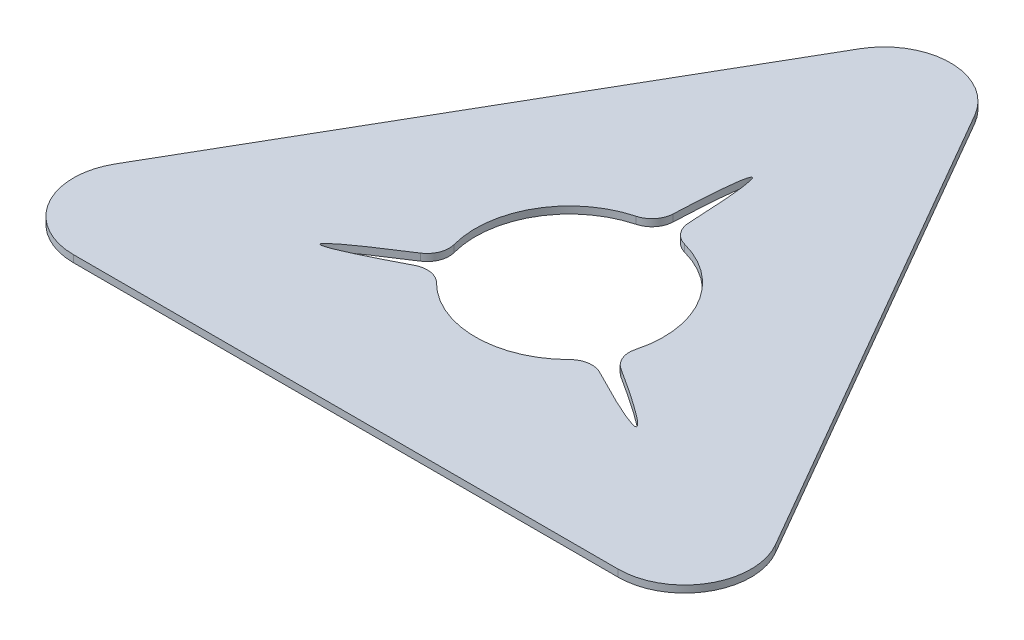
ISO-10303-21;
HEADER;
FILE_DESCRIPTION(('STEP AP214'),'2;1');
FILE_NAME('part.step','',(''),(''),'','','');
FILE_SCHEMA(('AUTOMOTIVE_DESIGN { 1 0 10303 214 1 1 1 1 }'));
ENDSEC;
DATA;
#1=APPLICATION_CONTEXT('core data for automotive mechanical design processes');
#2=APPLICATION_PROTOCOL_DEFINITION('international standard','automotive_design',2000,#1);
#3=PRODUCT_CONTEXT('',#1,'mechanical');
#4=PRODUCT('Part','Part','',(#3));
#5=PRODUCT_RELATED_PRODUCT_CATEGORY('part','',(#4));
#6=PRODUCT_DEFINITION_FORMATION('','',#4);
#7=PRODUCT_DEFINITION_CONTEXT('part definition',#1,'design');
#8=PRODUCT_DEFINITION('design','',#6,#7);
#9=PRODUCT_DEFINITION_SHAPE('','',#8);
#10=(LENGTH_UNIT() NAMED_UNIT(*) SI_UNIT(.MILLI.,.METRE.));
#11=(NAMED_UNIT(*) PLANE_ANGLE_UNIT() SI_UNIT($,.RADIAN.));
#12=(NAMED_UNIT(*) SI_UNIT($,.STERADIAN.) SOLID_ANGLE_UNIT());
#13=UNCERTAINTY_MEASURE_WITH_UNIT(LENGTH_MEASURE(1.E-05),#10,'distance_accuracy_value','');
#14=(GEOMETRIC_REPRESENTATION_CONTEXT(3) GLOBAL_UNCERTAINTY_ASSIGNED_CONTEXT((#13)) GLOBAL_UNIT_ASSIGNED_CONTEXT((#10,
#11,#12)) REPRESENTATION_CONTEXT('',''));
#15=CARTESIAN_POINT('',(0.,0.,0.));
#16=DIRECTION('',(0.,0.,1.));
#17=DIRECTION('',(1.,0.,0.));
#18=AXIS2_PLACEMENT_3D('',#15,#16,#17);
#19=CARTESIAN_POINT('',(0.,0.,404.145188432738));
#20=DIRECTION('',(0.,1.,0.));
#21=DIRECTION('',(0.,0.,1.));
#22=AXIS2_PLACEMENT_3D('',#19,#20,#21);
#23=CYLINDRICAL_SURFACE('',#22,85.);
#24=CARTESIAN_POINT('',(0.,6.35,404.145188432738));
#25=DIRECTION('',(0.,1.,0.));
#26=DIRECTION('',(0.,0.,1.));
#27=AXIS2_PLACEMENT_3D('',#24,#25,#26);
#28=CIRCLE('',#27,85.);
#29=CARTESIAN_POINT('',(-60.1874642350695,6.35,464.165761147035));
#30=VERTEX_POINT('',#29);
#31=CARTESIAN_POINT('',(60.1874642350686,6.35,464.165761147036));
#32=VERTEX_POINT('',#31);
#33=EDGE_CURVE('E290',#30,#32,#28,.T.);
#34=ORIENTED_EDGE('',*,*,#33,.T.);
#35=DIRECTION('',(0.,1.,0.));
#36=VECTOR('',#35,1.);
#37=CARTESIAN_POINT('',(60.1874642350686,0.,464.165761147036));
#38=LINE('',#37,#36);
#39=CARTESIAN_POINT('',(60.1874642350686,0.,464.165761147036));
#40=VERTEX_POINT('',#39);
#41=EDGE_CURVE('E248',#32,#40,#38,.F.);
#42=ORIENTED_EDGE('',*,*,#41,.T.);
#43=CARTESIAN_POINT('',(0.,0.,404.145188432738));
#44=DIRECTION('',(0.,1.,0.));
#45=DIRECTION('',(0.,0.,1.));
#46=AXIS2_PLACEMENT_3D('',#43,#44,#45);
#47=CIRCLE('',#46,85.);
#48=CARTESIAN_POINT('',(-60.1874642350695,0.,464.165761147035));
#49=VERTEX_POINT('',#48);
#50=EDGE_CURVE('E292',#49,#40,#47,.T.);
#51=ORIENTED_EDGE('',*,*,#50,.F.);
#52=DIRECTION('',(0.,1.,0.));
#53=VECTOR('',#52,1.);
#54=CARTESIAN_POINT('',(-60.1874642350695,0.,464.165761147035));
#55=LINE('',#54,#53);
#56=EDGE_CURVE('E245',#49,#30,#55,.T.);
#57=ORIENTED_EDGE('',*,*,#56,.T.);
#58=EDGE_LOOP('',(#34,#42,#51,#57));
#59=FACE_BOUND('',#58,.T.);
#60=ADVANCED_FACE('F33',(#59),#23,.F.);
#61=CARTESIAN_POINT('',(-21.8856086027386,6.35,322.011029058652));
#62=VERTEX_POINT('',#61);
#63=CARTESIAN_POINT('',(-82.0730728378077,6.35,426.258775092525));
#64=VERTEX_POINT('',#63);
#65=EDGE_CURVE('E281',#62,#64,#28,.T.);
#66=ORIENTED_EDGE('',*,*,#65,.T.);
#67=DIRECTION('',(0.,1.,0.));
#68=VECTOR('',#67,1.);
#69=CARTESIAN_POINT('',(-82.0730728378077,0.,426.258775092525));
#70=LINE('',#69,#68);
#71=CARTESIAN_POINT('',(-82.0730728378077,0.,426.258775092525));
#72=VERTEX_POINT('',#71);
#73=EDGE_CURVE('E257',#64,#72,#70,.F.);
#74=ORIENTED_EDGE('',*,*,#73,.T.);
#75=CARTESIAN_POINT('',(-21.8856086027386,0.,322.011029058652));
#76=VERTEX_POINT('',#75);
#77=EDGE_CURVE('E190',#76,#72,#47,.T.);
#78=ORIENTED_EDGE('',*,*,#77,.F.);
#79=DIRECTION('',(0.,1.,0.));
#80=VECTOR('',#79,1.);
#81=CARTESIAN_POINT('',(-21.8856086027386,0.,322.011029058652));
#82=LINE('',#81,#80);
#83=EDGE_CURVE('E254',#76,#62,#82,.T.);
#84=ORIENTED_EDGE('',*,*,#83,.T.);
#85=EDGE_LOOP('',(#66,#74,#78,#84));
#86=FACE_BOUND('',#85,.T.);
#87=ADVANCED_FACE('F280',(#86),#23,.F.);
#88=CARTESIAN_POINT('',(350.,6.35,606.217782649107));
#89=DIRECTION('',(-0.866025403784439,0.,0.5));
#90=DIRECTION('',(0.5,0.,0.866025403784439));
#91=AXIS2_PLACEMENT_3D('',#88,#89,#90);
#92=PLANE('',#91);
#93=DIRECTION('',(-0.5,0.,-0.866025403784439));
#94=VECTOR('',#93,1.);
#95=CARTESIAN_POINT('',(350.,0.,606.217782649107));
#96=LINE('',#95,#94);
#97=CARTESIAN_POINT('',(298.038475772933,0.,516.217782649107));
#98=VERTEX_POINT('',#97);
#99=CARTESIAN_POINT('',(51.9615242270664,0.,90.0000000000002));
#100=VERTEX_POINT('',#99);
#101=EDGE_CURVE('E185',#98,#100,#96,.T.);
#102=ORIENTED_EDGE('',*,*,#101,.T.);
#103=DIRECTION('',(0.,-1.,0.));
#104=VECTOR('',#103,1.);
#105=CARTESIAN_POINT('',(51.9615242270663,6.35,90.));
#106=LINE('',#105,#104);
#107=CARTESIAN_POINT('',(51.9615242270664,6.35,90.0000000000002));
#108=VERTEX_POINT('',#107);
#109=EDGE_CURVE('E163',#100,#108,#106,.F.);
#110=ORIENTED_EDGE('',*,*,#109,.T.);
#111=DIRECTION('',(-0.5,0.,-0.866025403784439));
#112=VECTOR('',#111,1.);
#113=CARTESIAN_POINT('',(350.,6.35,606.217782649107));
#114=LINE('',#113,#112);
#115=CARTESIAN_POINT('',(298.038475772933,6.35,516.217782649107));
#116=VERTEX_POINT('',#115);
#117=EDGE_CURVE('E188',#116,#108,#114,.T.);
#118=ORIENTED_EDGE('',*,*,#117,.F.);
#119=DIRECTION('',(0.,-1.,0.));
#120=VECTOR('',#119,1.);
#121=CARTESIAN_POINT('',(298.038475772933,6.35,516.217782649107));
#122=LINE('',#121,#120);
#123=EDGE_CURVE('E168',#116,#98,#122,.T.);
#124=ORIENTED_EDGE('',*,*,#123,.T.);
#125=EDGE_LOOP('',(#102,#110,#118,#124));
#126=FACE_BOUND('',#125,.T.);
#127=ADVANCED_FACE('F367',(#126),#92,.F.);
#128=CARTESIAN_POINT('',(0.,6.35,0.));
#129=DIRECTION('',(0.866025403784439,0.,0.5));
#130=DIRECTION('',(0.5,0.,-0.866025403784439));
#131=AXIS2_PLACEMENT_3D('',#128,#129,#130);
#132=PLANE('',#131);
#133=DIRECTION('',(-0.5,0.,0.866025403784439));
#134=VECTOR('',#133,1.);
#135=CARTESIAN_POINT('',(0.,6.35,0.));
#136=LINE('',#135,#134);
#137=CARTESIAN_POINT('',(-51.9615242270663,6.35,90.));
#138=VERTEX_POINT('',#137);
#139=CARTESIAN_POINT('',(-298.038475772934,6.35,516.217782649107));
#140=VERTEX_POINT('',#139);
#141=EDGE_CURVE('E178',#138,#140,#136,.T.);
#142=ORIENTED_EDGE('',*,*,#141,.F.);
#143=DIRECTION('',(0.,-1.,0.));
#144=VECTOR('',#143,1.);
#145=CARTESIAN_POINT('',(-51.9615242270663,6.35,90.));
#146=LINE('',#145,#144);
#147=CARTESIAN_POINT('',(-51.9615242270663,0.,90.));
#148=VERTEX_POINT('',#147);
#149=EDGE_CURVE('E162',#138,#148,#146,.T.);
#150=ORIENTED_EDGE('',*,*,#149,.T.);
#151=DIRECTION('',(-0.5,0.,0.866025403784439));
#152=VECTOR('',#151,1.);
#153=CARTESIAN_POINT('',(0.,0.,0.));
#154=LINE('',#153,#152);
#155=CARTESIAN_POINT('',(-298.038475772934,0.,516.217782649107));
#156=VERTEX_POINT('',#155);
#157=EDGE_CURVE('E175',#148,#156,#154,.T.);
#158=ORIENTED_EDGE('',*,*,#157,.T.);
#159=DIRECTION('',(0.,-1.,0.));
#160=VECTOR('',#159,1.);
#161=CARTESIAN_POINT('',(-298.038475772934,6.35,516.217782649107));
#162=LINE('',#161,#160);
#163=EDGE_CURVE('E180',#156,#140,#162,.F.);
#164=ORIENTED_EDGE('',*,*,#163,.T.);
#165=EDGE_LOOP('',(#142,#150,#158,#164));
#166=FACE_BOUND('',#165,.T.);
#167=ADVANCED_FACE('F174',(#166),#132,.F.);
#168=CARTESIAN_POINT('',(-350.,6.35,606.217782649107));
#169=DIRECTION('',(0.,0.,-1.));
#170=DIRECTION('',(-1.,0.,0.));
#171=AXIS2_PLACEMENT_3D('',#168,#169,#170);
#172=PLANE('',#171);
#173=DIRECTION('',(1.,0.,0.));
#174=VECTOR('',#173,1.);
#175=CARTESIAN_POINT('',(-350.,0.,606.217782649107));
#176=LINE('',#175,#174);
#177=CARTESIAN_POINT('',(-246.076951545867,0.,606.217782649107));
#178=VERTEX_POINT('',#177);
#179=CARTESIAN_POINT('',(246.076951545867,0.,606.217782649107));
#180=VERTEX_POINT('',#179);
#181=EDGE_CURVE('E184',#178,#180,#176,.T.);
#182=ORIENTED_EDGE('',*,*,#181,.T.);
#183=DIRECTION('',(0.,-1.,0.));
#184=VECTOR('',#183,1.);
#185=CARTESIAN_POINT('',(246.076951545867,6.35,606.217782649107));
#186=LINE('',#185,#184);
#187=CARTESIAN_POINT('',(246.076951545867,6.35,606.217782649107));
#188=VERTEX_POINT('',#187);
#189=EDGE_CURVE('E210',#180,#188,#186,.F.);
#190=ORIENTED_EDGE('',*,*,#189,.T.);
#191=DIRECTION('',(1.,0.,0.));
#192=VECTOR('',#191,1.);
#193=CARTESIAN_POINT('',(-350.,6.35,606.217782649107));
#194=LINE('',#193,#192);
#195=CARTESIAN_POINT('',(-246.076951545867,6.35,606.217782649107));
#196=VERTEX_POINT('',#195);
#197=EDGE_CURVE('E194',#196,#188,#194,.T.);
#198=ORIENTED_EDGE('',*,*,#197,.F.);
#199=DIRECTION('',(0.,-1.,0.));
#200=VECTOR('',#199,1.);
#201=CARTESIAN_POINT('',(-246.076951545867,6.35,606.217782649107));
#202=LINE('',#201,#200);
#203=EDGE_CURVE('E207',#196,#178,#202,.T.);
#204=ORIENTED_EDGE('',*,*,#203,.T.);
#205=EDGE_LOOP('',(#182,#190,#198,#204));
#206=FACE_BOUND('',#205,.T.);
#207=ADVANCED_FACE('F359',(#206),#172,.F.);
#208=CARTESIAN_POINT('',(0.,6.35,0.));
#209=DIRECTION('',(0.,1.,0.));
#210=DIRECTION('',(0.,0.,1.));
#211=AXIS2_PLACEMENT_3D('',#208,#209,#210);
#212=PLANE('',#211);
#213=CARTESIAN_POINT('',(82.0730728378073,6.35,426.258775092526));
#214=VERTEX_POINT('',#213);
#215=CARTESIAN_POINT('',(21.8856086027386,6.35,322.011029058652));
#216=VERTEX_POINT('',#215);
#217=EDGE_CURVE('E274',#214,#216,#28,.T.);
#218=ORIENTED_EDGE('',*,*,#217,.F.);
#219=CARTESIAN_POINT('',(101.384384093762,6.35,431.461971953653));
#220=DIRECTION('',(0.,1.,0.));
#221=DIRECTION('',(0.,0.,1.));
#222=AXIS2_PLACEMENT_3D('',#219,#220,#221);
#223=CIRCLE('',#222,20.);
#224=CARTESIAN_POINT('',(90.6394431593238,6.35,448.330470532822));
#225=VERTEX_POINT('',#224);
#226=EDGE_CURVE('E228',#214,#225,#223,.T.);
#227=ORIENTED_EDGE('',*,*,#226,.T.);
#228=CARTESIAN_POINT('',(21.4807621135331,6.35,426.939417066798));
#229=CARTESIAN_POINT('',(545.596004384195,6.35,719.14518843274));
#230=CARTESIAN_POINT('',(30.4807621135332,6.35,411.350959798678));
#231=(BOUNDED_CURVE() B_SPLINE_CURVE(2,(#228,#229,#230),.UNSPECIFIED.,.F.,
.F.) B_SPLINE_CURVE_WITH_KNOTS((3,3),(0.,1.),
.UNSPECIFIED.) CURVE() GEOMETRIC_REPRESENTATION_ITEM() RATIONAL_B_SPLINE_CURVE((1.,
0.290322580645161,1.)) REPRESENTATION_ITEM(''));
#232=CARTESIAN_POINT('',(83.585298351716,6.35,460.548607743546));
#233=VERTEX_POINT('',#232);
#234=EDGE_CURVE('E307',#233,#225,#231,.T.);
#235=ORIENTED_EDGE('',*,*,#234,.F.);
#236=CARTESIAN_POINT('',(74.3492205256728,6.35,478.288248844518));
#237=DIRECTION('',(0.,1.,0.));
#238=DIRECTION('',(0.,0.,1.));
#239=AXIS2_PLACEMENT_3D('',#236,#237,#238);
#240=CIRCLE('',#239,20.);
#241=EDGE_CURVE('E226',#233,#32,#240,.T.);
#242=ORIENTED_EDGE('',*,*,#241,.T.);
#243=ORIENTED_EDGE('',*,*,#33,.F.);
#244=CARTESIAN_POINT('',(-74.3492205256741,6.35,478.288248844517));
#245=DIRECTION('',(0.,1.,0.));
#246=DIRECTION('',(0.,0.,1.));
#247=AXIS2_PLACEMENT_3D('',#244,#245,#246);
#248=CIRCLE('',#247,20.);
#249=CARTESIAN_POINT('',(-83.5852983517173,6.35,460.548607743545));
#250=VERTEX_POINT('',#249);
#251=EDGE_CURVE('E224',#30,#250,#248,.T.);
#252=ORIENTED_EDGE('',*,*,#251,.T.);
#253=CARTESIAN_POINT('',(-30.4807621135332,6.35,411.350959798678));
#254=CARTESIAN_POINT('',(-545.596004384199,6.35,719.145188432733));
#255=CARTESIAN_POINT('',(-21.4807621135333,6.35,426.939417066797));
#256=(BOUNDED_CURVE() B_SPLINE_CURVE(2,(#253,#254,#255),.UNSPECIFIED.,.F.,
.F.) B_SPLINE_CURVE_WITH_KNOTS((3,3),(0.,1.),
.UNSPECIFIED.) CURVE() GEOMETRIC_REPRESENTATION_ITEM() RATIONAL_B_SPLINE_CURVE((1.,
0.290322580645161,1.)) REPRESENTATION_ITEM(''));
#257=CARTESIAN_POINT('',(-90.6394431593245,6.35,448.330470532821));
#258=VERTEX_POINT('',#257);
#259=EDGE_CURVE('E328',#258,#250,#256,.T.);
#260=ORIENTED_EDGE('',*,*,#259,.F.);
#261=CARTESIAN_POINT('',(-101.384384093762,6.35,431.461971953652));
#262=DIRECTION('',(0.,1.,0.));
#263=DIRECTION('',(0.,0.,1.));
#264=AXIS2_PLACEMENT_3D('',#261,#262,#263);
#265=CIRCLE('',#264,20.);
#266=EDGE_CURVE('E222',#258,#64,#265,.T.);
#267=ORIENTED_EDGE('',*,*,#266,.T.);
#268=ORIENTED_EDGE('',*,*,#65,.F.);
#269=CARTESIAN_POINT('',(-27.0351635680888,6.35,302.685344500044));
#270=DIRECTION('',(0.,1.,0.));
#271=DIRECTION('',(0.,0.,1.));
#272=AXIS2_PLACEMENT_3D('',#269,#270,#271);
#273=CIRCLE('',#272,20.);
#274=CARTESIAN_POINT('',(-7.05414480760747,6.35,303.556487021846));
#275=VERTEX_POINT('',#274);
#276=EDGE_CURVE('E218',#62,#275,#273,.T.);
#277=ORIENTED_EDGE('',*,*,#276,.T.);
#278=CARTESIAN_POINT('',(8.99999999999999,6.35,374.145188432738));
#279=CARTESIAN_POINT('',(0.,6.35,-225.854811567262));
#280=CARTESIAN_POINT('',(-9.00000000000001,6.35,374.145188432738));
#281=(BOUNDED_CURVE() B_SPLINE_CURVE(2,(#278,#279,#280),.UNSPECIFIED.,.F.,
.F.) B_SPLINE_CURVE_WITH_KNOTS((3,3),(0.,1.),
.UNSPECIFIED.) CURVE() GEOMETRIC_REPRESENTATION_ITEM() RATIONAL_B_SPLINE_CURVE((1.,
0.290322580645161,1.)) REPRESENTATION_ITEM(''));
#282=CARTESIAN_POINT('',(7.05414480760746,6.35,303.556487021846));
#283=VERTEX_POINT('',#282);
#284=EDGE_CURVE('E268',#283,#275,#281,.T.);
#285=ORIENTED_EDGE('',*,*,#284,.F.);
#286=CARTESIAN_POINT('',(27.0351635680888,6.35,302.685344500044));
#287=DIRECTION('',(0.,1.,0.));
#288=DIRECTION('',(0.,0.,1.));
#289=AXIS2_PLACEMENT_3D('',#286,#287,#288);
#290=CIRCLE('',#289,20.);
#291=EDGE_CURVE('E220',#283,#216,#290,.T.);
#292=ORIENTED_EDGE('',*,*,#291,.T.);
#293=EDGE_LOOP('',(#218,#227,#235,#242,#243,#252,#260,#267,#268,#277,#285,#292));
#294=FACE_BOUND('',#293,.T.);
#295=ORIENTED_EDGE('',*,*,#117,.T.);
#296=CARTESIAN_POINT('',(0.,6.35,120.));
#297=DIRECTION('',(0.,1.,0.));
#298=DIRECTION('',(0.,0.,1.));
#299=AXIS2_PLACEMENT_3D('',#296,#297,#298);
#300=CIRCLE('',#299,60.);
#301=EDGE_CURVE('E205',#108,#138,#300,.T.);
#302=ORIENTED_EDGE('',*,*,#301,.T.);
#303=ORIENTED_EDGE('',*,*,#141,.T.);
#304=CARTESIAN_POINT('',(-246.076951545867,6.35,546.217782649107));
#305=DIRECTION('',(0.,1.,0.));
#306=DIRECTION('',(0.,0.,1.));
#307=AXIS2_PLACEMENT_3D('',#304,#305,#306);
#308=CIRCLE('',#307,60.);
#309=EDGE_CURVE('E201',#140,#196,#308,.T.);
#310=ORIENTED_EDGE('',*,*,#309,.T.);
#311=ORIENTED_EDGE('',*,*,#197,.T.);
#312=CARTESIAN_POINT('',(246.076951545867,6.35,546.217782649107));
#313=DIRECTION('',(0.,1.,0.));
#314=DIRECTION('',(0.,0.,1.));
#315=AXIS2_PLACEMENT_3D('',#312,#313,#314);
#316=CIRCLE('',#315,60.);
#317=EDGE_CURVE('E203',#188,#116,#316,.T.);
#318=ORIENTED_EDGE('',*,*,#317,.T.);
#319=EDGE_LOOP('',(#295,#302,#303,#310,#311,#318));
#320=FACE_BOUND('',#319,.T.);
#321=ADVANCED_FACE('F285',(#294,#320),#212,.T.);
#322=CARTESIAN_POINT('',(0.,0.,0.));
#323=DIRECTION('',(0.,1.,0.));
#324=DIRECTION('',(0.,0.,1.));
#325=AXIS2_PLACEMENT_3D('',#322,#323,#324);
#326=PLANE('',#325);
#327=CARTESIAN_POINT('',(21.4807621135331,0.,426.939417066798));
#328=CARTESIAN_POINT('',(545.596004384195,0.,719.14518843274));
#329=CARTESIAN_POINT('',(30.4807621135332,0.,411.350959798678));
#330=(BOUNDED_CURVE() B_SPLINE_CURVE(2,(#327,#328,#329),.UNSPECIFIED.,.F.,
.F.) B_SPLINE_CURVE_WITH_KNOTS((3,3),(0.,1.),
.UNSPECIFIED.) CURVE() GEOMETRIC_REPRESENTATION_ITEM() RATIONAL_B_SPLINE_CURVE((1.,
0.290322580645161,1.)) REPRESENTATION_ITEM(''));
#331=CARTESIAN_POINT('',(83.585298351716,0.,460.548607743546));
#332=VERTEX_POINT('',#331);
#333=CARTESIAN_POINT('',(90.6394431593238,0.,448.330470532822));
#334=VERTEX_POINT('',#333);
#335=EDGE_CURVE('E305',#332,#334,#330,.T.);
#336=ORIENTED_EDGE('',*,*,#335,.T.);
#337=CARTESIAN_POINT('',(101.384384093762,0.,431.461971953653));
#338=DIRECTION('',(0.,1.,0.));
#339=DIRECTION('',(0.,0.,1.));
#340=AXIS2_PLACEMENT_3D('',#337,#338,#339);
#341=CIRCLE('',#340,20.);
#342=CARTESIAN_POINT('',(82.0730728378073,0.,426.258775092526));
#343=VERTEX_POINT('',#342);
#344=EDGE_CURVE('E243',#334,#343,#341,.F.);
#345=ORIENTED_EDGE('',*,*,#344,.T.);
#346=CARTESIAN_POINT('',(21.8856086027386,0.,322.011029058652));
#347=VERTEX_POINT('',#346);
#348=EDGE_CURVE('E289',#343,#347,#47,.T.);
#349=ORIENTED_EDGE('',*,*,#348,.T.);
#350=CARTESIAN_POINT('',(27.0351635680888,0.,302.685344500044));
#351=DIRECTION('',(0.,1.,0.));
#352=DIRECTION('',(0.,0.,1.));
#353=AXIS2_PLACEMENT_3D('',#350,#351,#352);
#354=CIRCLE('',#353,20.);
#355=CARTESIAN_POINT('',(7.05414480760746,0.,303.556487021846));
#356=VERTEX_POINT('',#355);
#357=EDGE_CURVE('E236',#347,#356,#354,.F.);
#358=ORIENTED_EDGE('',*,*,#357,.T.);
#359=CARTESIAN_POINT('',(8.99999999999999,0.,374.145188432738));
#360=CARTESIAN_POINT('',(0.,0.,-225.854811567262));
#361=CARTESIAN_POINT('',(-9.00000000000001,0.,374.145188432738));
#362=(BOUNDED_CURVE() B_SPLINE_CURVE(2,(#359,#360,#361),.UNSPECIFIED.,.F.,
.F.) B_SPLINE_CURVE_WITH_KNOTS((3,3),(0.,1.),
.UNSPECIFIED.) CURVE() GEOMETRIC_REPRESENTATION_ITEM() RATIONAL_B_SPLINE_CURVE((1.,
0.290322580645161,1.)) REPRESENTATION_ITEM(''));
#363=CARTESIAN_POINT('',(-7.05414480760747,0.,303.556487021846));
#364=VERTEX_POINT('',#363);
#365=EDGE_CURVE('E265',#356,#364,#362,.T.);
#366=ORIENTED_EDGE('',*,*,#365,.T.);
#367=CARTESIAN_POINT('',(-27.0351635680888,0.,302.685344500044));
#368=DIRECTION('',(0.,1.,0.));
#369=DIRECTION('',(0.,0.,1.));
#370=AXIS2_PLACEMENT_3D('',#367,#368,#369);
#371=CIRCLE('',#370,20.);
#372=EDGE_CURVE('E234',#364,#76,#371,.F.);
#373=ORIENTED_EDGE('',*,*,#372,.T.);
#374=ORIENTED_EDGE('',*,*,#77,.T.);
#375=CARTESIAN_POINT('',(-101.384384093762,0.,431.461971953652));
#376=DIRECTION('',(0.,1.,0.));
#377=DIRECTION('',(0.,0.,1.));
#378=AXIS2_PLACEMENT_3D('',#375,#376,#377);
#379=CIRCLE('',#378,20.);
#380=CARTESIAN_POINT('',(-90.6394431593245,0.,448.330470532821));
#381=VERTEX_POINT('',#380);
#382=EDGE_CURVE('E55',#72,#381,#379,.F.);
#383=ORIENTED_EDGE('',*,*,#382,.T.);
#384=CARTESIAN_POINT('',(-30.4807621135332,0.,411.350959798678));
#385=CARTESIAN_POINT('',(-545.596004384199,0.,719.145188432733));
#386=CARTESIAN_POINT('',(-21.4807621135333,0.,426.939417066797));
#387=(BOUNDED_CURVE() B_SPLINE_CURVE(2,(#384,#385,#386),.UNSPECIFIED.,.F.,
.F.) B_SPLINE_CURVE_WITH_KNOTS((3,3),(0.,1.),
.UNSPECIFIED.) CURVE() GEOMETRIC_REPRESENTATION_ITEM() RATIONAL_B_SPLINE_CURVE((1.,
0.290322580645161,1.)) REPRESENTATION_ITEM(''));
#388=CARTESIAN_POINT('',(-83.5852983517173,0.,460.548607743545));
#389=VERTEX_POINT('',#388);
#390=EDGE_CURVE('E331',#381,#389,#387,.T.);
#391=ORIENTED_EDGE('',*,*,#390,.T.);
#392=CARTESIAN_POINT('',(-74.3492205256741,0.,478.288248844517));
#393=DIRECTION('',(0.,1.,0.));
#394=DIRECTION('',(0.,0.,1.));
#395=AXIS2_PLACEMENT_3D('',#392,#393,#394);
#396=CIRCLE('',#395,20.);
#397=EDGE_CURVE('E239',#389,#49,#396,.F.);
#398=ORIENTED_EDGE('',*,*,#397,.T.);
#399=ORIENTED_EDGE('',*,*,#50,.T.);
#400=CARTESIAN_POINT('',(74.3492205256728,0.,478.288248844518));
#401=DIRECTION('',(0.,1.,0.));
#402=DIRECTION('',(0.,0.,1.));
#403=AXIS2_PLACEMENT_3D('',#400,#401,#402);
#404=CIRCLE('',#403,20.);
#405=EDGE_CURVE('E241',#40,#332,#404,.F.);
#406=ORIENTED_EDGE('',*,*,#405,.T.);
#407=EDGE_LOOP('',(#336,#345,#349,#358,#366,#373,#374,#383,#391,#398,#399,#406));
#408=FACE_BOUND('',#407,.T.);
#409=ORIENTED_EDGE('',*,*,#157,.F.);
#410=CARTESIAN_POINT('',(0.,0.,120.));
#411=DIRECTION('',(0.,1.,0.));
#412=DIRECTION('',(0.,0.,1.));
#413=AXIS2_PLACEMENT_3D('',#410,#411,#412);
#414=CIRCLE('',#413,60.);
#415=EDGE_CURVE('E158',#148,#100,#414,.F.);
#416=ORIENTED_EDGE('',*,*,#415,.T.);
#417=ORIENTED_EDGE('',*,*,#101,.F.);
#418=CARTESIAN_POINT('',(246.076951545867,0.,546.217782649107));
#419=DIRECTION('',(0.,1.,0.));
#420=DIRECTION('',(0.,0.,1.));
#421=AXIS2_PLACEMENT_3D('',#418,#419,#420);
#422=CIRCLE('',#421,60.);
#423=EDGE_CURVE('E169',#98,#180,#422,.F.);
#424=ORIENTED_EDGE('',*,*,#423,.T.);
#425=ORIENTED_EDGE('',*,*,#181,.F.);
#426=CARTESIAN_POINT('',(-246.076951545867,0.,546.217782649107));
#427=DIRECTION('',(0.,1.,0.));
#428=DIRECTION('',(0.,0.,1.));
#429=AXIS2_PLACEMENT_3D('',#426,#427,#428);
#430=CIRCLE('',#429,60.);
#431=EDGE_CURVE('E179',#178,#156,#430,.F.);
#432=ORIENTED_EDGE('',*,*,#431,.T.);
#433=EDGE_LOOP('',(#409,#416,#417,#424,#425,#432));
#434=FACE_BOUND('',#433,.T.);
#435=ADVANCED_FACE('F182',(#408,#434),#326,.F.);
#436=ORIENTED_EDGE('',*,*,#348,.F.);
#437=DIRECTION('',(0.,1.,0.));
#438=VECTOR('',#437,1.);
#439=CARTESIAN_POINT('',(82.0730728378073,0.,426.258775092526));
#440=LINE('',#439,#438);
#441=EDGE_CURVE('E215',#343,#214,#440,.T.);
#442=ORIENTED_EDGE('',*,*,#441,.T.);
#443=ORIENTED_EDGE('',*,*,#217,.T.);
#444=DIRECTION('',(0.,1.,0.));
#445=VECTOR('',#444,1.);
#446=CARTESIAN_POINT('',(21.8856086027386,0.,322.011029058652));
#447=LINE('',#446,#445);
#448=EDGE_CURVE('E212',#216,#347,#447,.F.);
#449=ORIENTED_EDGE('',*,*,#448,.T.);
#450=EDGE_LOOP('',(#436,#442,#443,#449));
#451=FACE_BOUND('',#450,.T.);
#452=ADVANCED_FACE('F300',(#451),#23,.F.);
#453=CARTESIAN_POINT('',(0.,6.35,120.));
#454=DIRECTION('',(0.,-1.,0.));
#455=DIRECTION('',(0.,0.,-1.));
#456=AXIS2_PLACEMENT_3D('',#453,#454,#455);
#457=CYLINDRICAL_SURFACE('',#456,60.);
#458=ORIENTED_EDGE('',*,*,#301,.F.);
#459=ORIENTED_EDGE('',*,*,#109,.F.);
#460=ORIENTED_EDGE('',*,*,#415,.F.);
#461=ORIENTED_EDGE('',*,*,#149,.F.);
#462=EDGE_LOOP('',(#458,#459,#460,#461));
#463=FACE_BOUND('',#462,.T.);
#464=ADVANCED_FACE('F161',(#463),#457,.T.);
#465=CARTESIAN_POINT('',(246.076951545867,6.35,546.217782649107));
#466=DIRECTION('',(0.,-1.,0.));
#467=DIRECTION('',(0.,0.,-1.));
#468=AXIS2_PLACEMENT_3D('',#465,#466,#467);
#469=CYLINDRICAL_SURFACE('',#468,60.);
#470=ORIENTED_EDGE('',*,*,#317,.F.);
#471=ORIENTED_EDGE('',*,*,#189,.F.);
#472=ORIENTED_EDGE('',*,*,#423,.F.);
#473=ORIENTED_EDGE('',*,*,#123,.F.);
#474=EDGE_LOOP('',(#470,#471,#472,#473));
#475=FACE_BOUND('',#474,.T.);
#476=ADVANCED_FACE('F373',(#475),#469,.T.);
#477=CARTESIAN_POINT('',(-246.076951545867,6.35,546.217782649107));
#478=DIRECTION('',(0.,-1.,0.));
#479=DIRECTION('',(0.,0.,-1.));
#480=AXIS2_PLACEMENT_3D('',#477,#478,#479);
#481=CYLINDRICAL_SURFACE('',#480,60.);
#482=ORIENTED_EDGE('',*,*,#309,.F.);
#483=ORIENTED_EDGE('',*,*,#163,.F.);
#484=ORIENTED_EDGE('',*,*,#431,.F.);
#485=ORIENTED_EDGE('',*,*,#203,.F.);
#486=EDGE_LOOP('',(#482,#483,#484,#485));
#487=FACE_BOUND('',#486,.T.);
#488=ADVANCED_FACE('F354',(#487),#481,.T.);
#489=DIRECTION('',(0.,1.,0.));
#490=VECTOR('',#489,1.);
#491=SURFACE_OF_LINEAR_EXTRUSION('',#362,#490);
#492=ORIENTED_EDGE('',*,*,#365,.F.);
#493=DIRECTION('',(0.,1.,0.));
#494=VECTOR('',#493,1.);
#495=CARTESIAN_POINT('',(7.05414480760746,0.,303.556487021846));
#496=LINE('',#495,#494);
#497=EDGE_CURVE('E11',#356,#283,#496,.T.);
#498=ORIENTED_EDGE('',*,*,#497,.T.);
#499=ORIENTED_EDGE('',*,*,#284,.T.);
#500=DIRECTION('',(0.,1.,0.));
#501=VECTOR('',#500,1.);
#502=CARTESIAN_POINT('',(-7.05414480760748,6.35,303.556487021846));
#503=LINE('',#502,#501);
#504=EDGE_CURVE('E41',#275,#364,#503,.F.);
#505=ORIENTED_EDGE('',*,*,#504,.T.);
#506=EDGE_LOOP('',(#492,#498,#499,#505));
#507=FACE_BOUND('',#506,.T.);
#508=ADVANCED_FACE('F264',(#507),#491,.F.);
#509=DIRECTION('',(0.,1.,0.));
#510=VECTOR('',#509,1.);
#511=SURFACE_OF_LINEAR_EXTRUSION('',#387,#510);
#512=ORIENTED_EDGE('',*,*,#259,.T.);
#513=DIRECTION('',(0.,1.,0.));
#514=VECTOR('',#513,1.);
#515=CARTESIAN_POINT('',(-83.5852983517173,6.35,460.548607743545));
#516=LINE('',#515,#514);
#517=EDGE_CURVE('E48',#250,#389,#516,.F.);
#518=ORIENTED_EDGE('',*,*,#517,.T.);
#519=ORIENTED_EDGE('',*,*,#390,.F.);
#520=DIRECTION('',(0.,1.,0.));
#521=VECTOR('',#520,1.);
#522=CARTESIAN_POINT('',(-90.6394431593245,0.,448.330470532821));
#523=LINE('',#522,#521);
#524=EDGE_CURVE('E251',#381,#258,#523,.T.);
#525=ORIENTED_EDGE('',*,*,#524,.T.);
#526=EDGE_LOOP('',(#512,#518,#519,#525));
#527=FACE_BOUND('',#526,.T.);
#528=ADVANCED_FACE('F329',(#527),#511,.F.);
#529=DIRECTION('',(0.,1.,0.));
#530=VECTOR('',#529,1.);
#531=SURFACE_OF_LINEAR_EXTRUSION('',#330,#530);
#532=ORIENTED_EDGE('',*,*,#234,.T.);
#533=DIRECTION('',(0.,1.,0.));
#534=VECTOR('',#533,1.);
#535=CARTESIAN_POINT('',(90.6394431593238,6.35,448.330470532822));
#536=LINE('',#535,#534);
#537=EDGE_CURVE('E232',#225,#334,#536,.F.);
#538=ORIENTED_EDGE('',*,*,#537,.T.);
#539=ORIENTED_EDGE('',*,*,#335,.F.);
#540=DIRECTION('',(0.,1.,0.));
#541=VECTOR('',#540,1.);
#542=CARTESIAN_POINT('',(83.5852983517161,0.,460.548607743546));
#543=LINE('',#542,#541);
#544=EDGE_CURVE('E230',#332,#233,#543,.T.);
#545=ORIENTED_EDGE('',*,*,#544,.T.);
#546=EDGE_LOOP('',(#532,#538,#539,#545));
#547=FACE_BOUND('',#546,.T.);
#548=ADVANCED_FACE('F351',(#547),#531,.F.);
#549=CARTESIAN_POINT('',(101.384384093762,3.175,431.461971953653));
#550=DIRECTION('',(0.,1.,0.));
#551=DIRECTION('',(0.,0.,1.));
#552=AXIS2_PLACEMENT_3D('',#549,#550,#551);
#553=CYLINDRICAL_SURFACE('',#552,20.);
#554=ORIENTED_EDGE('',*,*,#344,.F.);
#555=ORIENTED_EDGE('',*,*,#537,.F.);
#556=ORIENTED_EDGE('',*,*,#226,.F.);
#557=ORIENTED_EDGE('',*,*,#441,.F.);
#558=EDGE_LOOP('',(#554,#555,#556,#557));
#559=FACE_BOUND('',#558,.T.);
#560=ADVANCED_FACE('F380',(#559),#553,.T.);
#561=CARTESIAN_POINT('',(74.3492205256728,3.175,478.288248844518));
#562=DIRECTION('',(0.,1.,0.));
#563=DIRECTION('',(0.,0.,1.));
#564=AXIS2_PLACEMENT_3D('',#561,#562,#563);
#565=CYLINDRICAL_SURFACE('',#564,20.);
#566=ORIENTED_EDGE('',*,*,#241,.F.);
#567=ORIENTED_EDGE('',*,*,#544,.F.);
#568=ORIENTED_EDGE('',*,*,#405,.F.);
#569=ORIENTED_EDGE('',*,*,#41,.F.);
#570=EDGE_LOOP('',(#566,#567,#568,#569));
#571=FACE_BOUND('',#570,.T.);
#572=ADVANCED_FACE('F383',(#571),#565,.T.);
#573=CARTESIAN_POINT('',(-74.3492205256741,3.175,478.288248844517));
#574=DIRECTION('',(0.,1.,0.));
#575=DIRECTION('',(0.,0.,1.));
#576=AXIS2_PLACEMENT_3D('',#573,#574,#575);
#577=CYLINDRICAL_SURFACE('',#576,20.);
#578=ORIENTED_EDGE('',*,*,#397,.F.);
#579=ORIENTED_EDGE('',*,*,#517,.F.);
#580=ORIENTED_EDGE('',*,*,#251,.F.);
#581=ORIENTED_EDGE('',*,*,#56,.F.);
#582=EDGE_LOOP('',(#578,#579,#580,#581));
#583=FACE_BOUND('',#582,.T.);
#584=ADVANCED_FACE('F327',(#583),#577,.T.);
#585=CARTESIAN_POINT('',(-101.384384093762,3.175,431.461971953652));
#586=DIRECTION('',(0.,1.,0.));
#587=DIRECTION('',(0.,0.,1.));
#588=AXIS2_PLACEMENT_3D('',#585,#586,#587);
#589=CYLINDRICAL_SURFACE('',#588,20.);
#590=ORIENTED_EDGE('',*,*,#266,.F.);
#591=ORIENTED_EDGE('',*,*,#524,.F.);
#592=ORIENTED_EDGE('',*,*,#382,.F.);
#593=ORIENTED_EDGE('',*,*,#73,.F.);
#594=EDGE_LOOP('',(#590,#591,#592,#593));
#595=FACE_BOUND('',#594,.T.);
#596=ADVANCED_FACE('F390',(#595),#589,.T.);
#597=CARTESIAN_POINT('',(27.0351635680888,3.175,302.685344500044));
#598=DIRECTION('',(0.,1.,0.));
#599=DIRECTION('',(0.,0.,1.));
#600=AXIS2_PLACEMENT_3D('',#597,#598,#599);
#601=CYLINDRICAL_SURFACE('',#600,20.);
#602=ORIENTED_EDGE('',*,*,#291,.F.);
#603=ORIENTED_EDGE('',*,*,#497,.F.);
#604=ORIENTED_EDGE('',*,*,#357,.F.);
#605=ORIENTED_EDGE('',*,*,#448,.F.);
#606=EDGE_LOOP('',(#602,#603,#604,#605));
#607=FACE_BOUND('',#606,.T.);
#608=ADVANCED_FACE('F304',(#607),#601,.T.);
#609=CARTESIAN_POINT('',(-27.0351635680888,3.175,302.685344500044));
#610=DIRECTION('',(0.,1.,0.));
#611=DIRECTION('',(0.,0.,1.));
#612=AXIS2_PLACEMENT_3D('',#609,#610,#611);
#613=CYLINDRICAL_SURFACE('',#612,20.);
#614=ORIENTED_EDGE('',*,*,#372,.F.);
#615=ORIENTED_EDGE('',*,*,#504,.F.);
#616=ORIENTED_EDGE('',*,*,#276,.F.);
#617=ORIENTED_EDGE('',*,*,#83,.F.);
#618=EDGE_LOOP('',(#614,#615,#616,#617));
#619=FACE_BOUND('',#618,.T.);
#620=ADVANCED_FACE('F35',(#619),#613,.T.);
#621=CLOSED_SHELL('',(#60,#87,#127,#167,#207,#321,#435,#452,#464,#476,#488,#508,#528,#548,#560,
#572,#584,#596,#608,#620));
#622=MANIFOLD_SOLID_BREP('B2',#621);
#623=ADVANCED_BREP_SHAPE_REPRESENTATION('',(#18,#622),#14);
#624=SHAPE_DEFINITION_REPRESENTATION(#9,#623);
ENDSEC;
END-ISO-10303-21;
